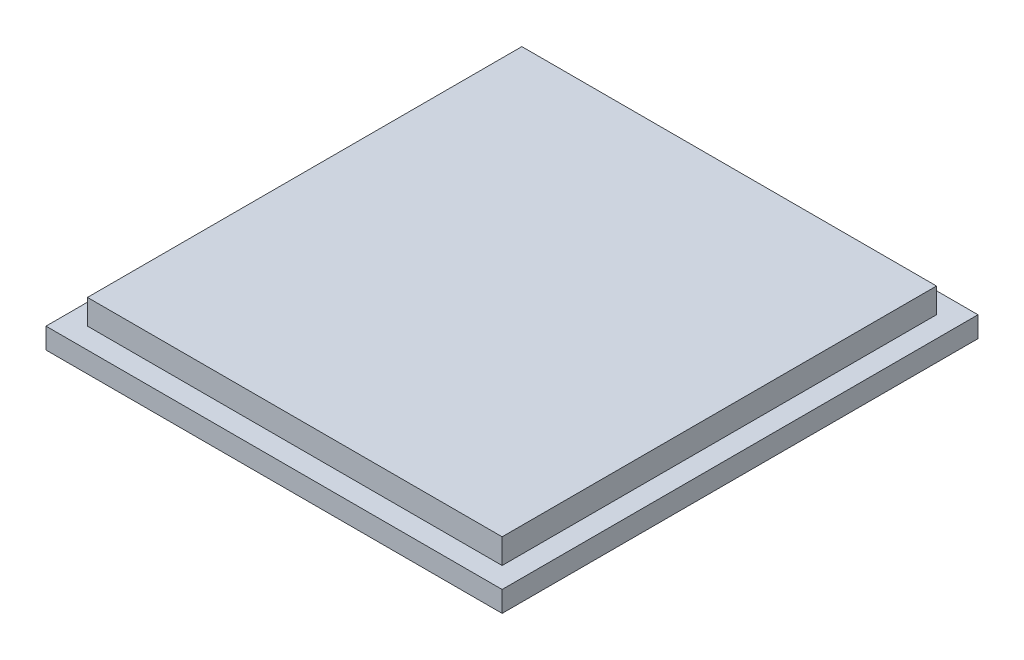
ISO-10303-21;
HEADER;
FILE_DESCRIPTION(('STEP AP214'),'2;1');
FILE_NAME('part.step','',(''),(''),'','','');
FILE_SCHEMA(('AUTOMOTIVE_DESIGN { 1 0 10303 214 1 1 1 1 }'));
ENDSEC;
DATA;
#1=APPLICATION_CONTEXT('core data for automotive mechanical design processes');
#2=APPLICATION_PROTOCOL_DEFINITION('international standard','automotive_design',2000,#1);
#3=PRODUCT_CONTEXT('',#1,'mechanical');
#4=PRODUCT('Part','Part','',(#3));
#5=PRODUCT_RELATED_PRODUCT_CATEGORY('part','',(#4));
#6=PRODUCT_DEFINITION_FORMATION('','',#4);
#7=PRODUCT_DEFINITION_CONTEXT('part definition',#1,'design');
#8=PRODUCT_DEFINITION('design','',#6,#7);
#9=PRODUCT_DEFINITION_SHAPE('','',#8);
#10=(LENGTH_UNIT() NAMED_UNIT(*) SI_UNIT(.MILLI.,.METRE.));
#11=(NAMED_UNIT(*) PLANE_ANGLE_UNIT() SI_UNIT($,.RADIAN.));
#12=(NAMED_UNIT(*) SI_UNIT($,.STERADIAN.) SOLID_ANGLE_UNIT());
#13=UNCERTAINTY_MEASURE_WITH_UNIT(LENGTH_MEASURE(1.E-05),#10,'distance_accuracy_value','');
#14=(GEOMETRIC_REPRESENTATION_CONTEXT(3) GLOBAL_UNCERTAINTY_ASSIGNED_CONTEXT((#13)) GLOBAL_UNIT_ASSIGNED_CONTEXT((#10,
#11,#12)) REPRESENTATION_CONTEXT('',''));
#15=CARTESIAN_POINT('',(0.,0.,0.));
#16=DIRECTION('',(0.,0.,1.));
#17=DIRECTION('',(1.,0.,0.));
#18=AXIS2_PLACEMENT_3D('',#15,#16,#17);
#19=CARTESIAN_POINT('',(0.,3.175,0.));
#20=DIRECTION('',(0.,-1.,0.));
#21=DIRECTION('',(0.,0.,-1.));
#22=AXIS2_PLACEMENT_3D('',#19,#20,#21);
#23=PLANE('',#22);
#24=DIRECTION('',(0.,0.,-1.));
#25=VECTOR('',#24,1.);
#26=CARTESIAN_POINT('',(34.925,3.175,36.4363));
#27=LINE('',#26,#25);
#28=CARTESIAN_POINT('',(34.925,3.175,36.4363));
#29=VERTEX_POINT('',#28);
#30=CARTESIAN_POINT('',(34.925,3.175,-36.4363));
#31=VERTEX_POINT('',#30);
#32=EDGE_CURVE('E139',#29,#31,#27,.T.);
#33=ORIENTED_EDGE('',*,*,#32,.T.);
#34=DIRECTION('',(-1.,0.,0.));
#35=VECTOR('',#34,1.);
#36=CARTESIAN_POINT('',(-34.925,3.175,-36.4363));
#37=LINE('',#36,#35);
#38=CARTESIAN_POINT('',(-34.925,3.175,-36.4363));
#39=VERTEX_POINT('',#38);
#40=EDGE_CURVE('E143',#31,#39,#37,.T.);
#41=ORIENTED_EDGE('',*,*,#40,.T.);
#42=DIRECTION('',(0.,0.,1.));
#43=VECTOR('',#42,1.);
#44=CARTESIAN_POINT('',(-34.925,3.175,36.4363));
#45=LINE('',#44,#43);
#46=CARTESIAN_POINT('',(-34.925,3.175,36.4363));
#47=VERTEX_POINT('',#46);
#48=EDGE_CURVE('E147',#39,#47,#45,.T.);
#49=ORIENTED_EDGE('',*,*,#48,.T.);
#50=DIRECTION('',(1.,0.,0.));
#51=VECTOR('',#50,1.);
#52=CARTESIAN_POINT('',(-34.925,3.175,36.4363));
#53=LINE('',#52,#51);
#54=EDGE_CURVE('E150',#47,#29,#53,.T.);
#55=ORIENTED_EDGE('',*,*,#54,.T.);
#56=EDGE_LOOP('',(#33,#41,#49,#55));
#57=FACE_BOUND('',#56,.T.);
#58=DIRECTION('',(1.,0.,0.));
#59=VECTOR('',#58,1.);
#60=CARTESIAN_POINT('',(-31.75,3.175,33.2613));
#61=LINE('',#60,#59);
#62=CARTESIAN_POINT('',(-31.75,3.175,33.2613));
#63=VERTEX_POINT('',#62);
#64=CARTESIAN_POINT('',(31.75,3.175,33.2613));
#65=VERTEX_POINT('',#64);
#66=EDGE_CURVE('E55',#63,#65,#61,.T.);
#67=ORIENTED_EDGE('',*,*,#66,.F.);
#68=DIRECTION('',(0.,0.,1.));
#69=VECTOR('',#68,1.);
#70=CARTESIAN_POINT('',(-31.75,3.175,-33.2613));
#71=LINE('',#70,#69);
#72=CARTESIAN_POINT('',(-31.75,3.175,-33.2613));
#73=VERTEX_POINT('',#72);
#74=EDGE_CURVE('E59',#73,#63,#71,.T.);
#75=ORIENTED_EDGE('',*,*,#74,.F.);
#76=DIRECTION('',(-1.,0.,0.));
#77=VECTOR('',#76,1.);
#78=CARTESIAN_POINT('',(31.75,3.175,-33.2613));
#79=LINE('',#78,#77);
#80=CARTESIAN_POINT('',(31.75,3.175,-33.2613));
#81=VERTEX_POINT('',#80);
#82=EDGE_CURVE('E283',#81,#73,#79,.T.);
#83=ORIENTED_EDGE('',*,*,#82,.F.);
#84=DIRECTION('',(0.,0.,-1.));
#85=VECTOR('',#84,1.);
#86=CARTESIAN_POINT('',(31.75,3.175,33.2613));
#87=LINE('',#86,#85);
#88=EDGE_CURVE('E293',#65,#81,#87,.T.);
#89=ORIENTED_EDGE('',*,*,#88,.F.);
#90=EDGE_LOOP('',(#67,#75,#83,#89));
#91=FACE_BOUND('',#90,.T.);
#92=ADVANCED_FACE('F39',(#57,#91),#23,.F.);
#93=CARTESIAN_POINT('',(34.925,3.175,36.4363));
#94=DIRECTION('',(-1.,0.,0.));
#95=DIRECTION('',(0.,0.,1.));
#96=AXIS2_PLACEMENT_3D('',#93,#94,#95);
#97=PLANE('',#96);
#98=DIRECTION('',(0.,0.,-1.));
#99=VECTOR('',#98,1.);
#100=CARTESIAN_POINT('',(34.925,0.,36.4363));
#101=LINE('',#100,#99);
#102=CARTESIAN_POINT('',(34.925,0.,36.4363));
#103=VERTEX_POINT('',#102);
#104=CARTESIAN_POINT('',(34.925,0.,-36.4363));
#105=VERTEX_POINT('',#104);
#106=EDGE_CURVE('E128',#103,#105,#101,.T.);
#107=ORIENTED_EDGE('',*,*,#106,.T.);
#108=DIRECTION('',(0.,-1.,0.));
#109=VECTOR('',#108,1.);
#110=CARTESIAN_POINT('',(34.925,3.175,-36.4363));
#111=LINE('',#110,#109);
#112=EDGE_CURVE('E11',#31,#105,#111,.T.);
#113=ORIENTED_EDGE('',*,*,#112,.F.);
#114=ORIENTED_EDGE('',*,*,#32,.F.);
#115=DIRECTION('',(0.,-1.,0.));
#116=VECTOR('',#115,1.);
#117=CARTESIAN_POINT('',(34.925,3.175,36.4363));
#118=LINE('',#117,#116);
#119=EDGE_CURVE('E152',#29,#103,#118,.T.);
#120=ORIENTED_EDGE('',*,*,#119,.T.);
#121=EDGE_LOOP('',(#107,#113,#114,#120));
#122=FACE_BOUND('',#121,.T.);
#123=ADVANCED_FACE('F41',(#122),#97,.F.);
#124=CARTESIAN_POINT('',(-34.925,3.175,-36.4363));
#125=DIRECTION('',(0.,0.,1.));
#126=DIRECTION('',(1.,0.,0.));
#127=AXIS2_PLACEMENT_3D('',#124,#125,#126);
#128=PLANE('',#127);
#129=DIRECTION('',(-1.,0.,0.));
#130=VECTOR('',#129,1.);
#131=CARTESIAN_POINT('',(-34.925,0.,-36.4363));
#132=LINE('',#131,#130);
#133=CARTESIAN_POINT('',(-34.925,0.,-36.4363));
#134=VERTEX_POINT('',#133);
#135=EDGE_CURVE('E133',#105,#134,#132,.T.);
#136=ORIENTED_EDGE('',*,*,#135,.T.);
#137=DIRECTION('',(0.,-1.,0.));
#138=VECTOR('',#137,1.);
#139=CARTESIAN_POINT('',(-34.925,3.175,-36.4363));
#140=LINE('',#139,#138);
#141=EDGE_CURVE('E48',#39,#134,#140,.T.);
#142=ORIENTED_EDGE('',*,*,#141,.F.);
#143=ORIENTED_EDGE('',*,*,#40,.F.);
#144=ORIENTED_EDGE('',*,*,#112,.T.);
#145=EDGE_LOOP('',(#136,#142,#143,#144));
#146=FACE_BOUND('',#145,.T.);
#147=ADVANCED_FACE('F188',(#146),#128,.F.);
#148=CARTESIAN_POINT('',(-34.925,3.175,36.4363));
#149=DIRECTION('',(1.,0.,0.));
#150=DIRECTION('',(0.,0.,-1.));
#151=AXIS2_PLACEMENT_3D('',#148,#149,#150);
#152=PLANE('',#151);
#153=DIRECTION('',(0.,0.,1.));
#154=VECTOR('',#153,1.);
#155=CARTESIAN_POINT('',(-34.925,0.,36.4363));
#156=LINE('',#155,#154);
#157=CARTESIAN_POINT('',(-34.925,0.,36.4363));
#158=VERTEX_POINT('',#157);
#159=EDGE_CURVE('E156',#134,#158,#156,.T.);
#160=ORIENTED_EDGE('',*,*,#159,.T.);
#161=DIRECTION('',(0.,-1.,0.));
#162=VECTOR('',#161,1.);
#163=CARTESIAN_POINT('',(-34.925,3.175,36.4363));
#164=LINE('',#163,#162);
#165=EDGE_CURVE('E164',#47,#158,#164,.T.);
#166=ORIENTED_EDGE('',*,*,#165,.F.);
#167=ORIENTED_EDGE('',*,*,#48,.F.);
#168=ORIENTED_EDGE('',*,*,#141,.T.);
#169=EDGE_LOOP('',(#160,#166,#167,#168));
#170=FACE_BOUND('',#169,.T.);
#171=ADVANCED_FACE('F173',(#170),#152,.F.);
#172=CARTESIAN_POINT('',(-34.925,3.175,36.4363));
#173=DIRECTION('',(0.,0.,-1.));
#174=DIRECTION('',(-1.,0.,0.));
#175=AXIS2_PLACEMENT_3D('',#172,#173,#174);
#176=PLANE('',#175);
#177=DIRECTION('',(1.,0.,0.));
#178=VECTOR('',#177,1.);
#179=CARTESIAN_POINT('',(-34.925,0.,36.4363));
#180=LINE('',#179,#178);
#181=EDGE_CURVE('E144',#158,#103,#180,.T.);
#182=ORIENTED_EDGE('',*,*,#181,.T.);
#183=ORIENTED_EDGE('',*,*,#119,.F.);
#184=ORIENTED_EDGE('',*,*,#54,.F.);
#185=ORIENTED_EDGE('',*,*,#165,.T.);
#186=EDGE_LOOP('',(#182,#183,#184,#185));
#187=FACE_BOUND('',#186,.T.);
#188=ADVANCED_FACE('F182',(#187),#176,.F.);
#189=CARTESIAN_POINT('',(0.,0.,0.));
#190=DIRECTION('',(0.,-1.,0.));
#191=DIRECTION('',(0.,0.,-1.));
#192=AXIS2_PLACEMENT_3D('',#189,#190,#191);
#193=PLANE('',#192);
#194=ORIENTED_EDGE('',*,*,#106,.F.);
#195=ORIENTED_EDGE('',*,*,#181,.F.);
#196=ORIENTED_EDGE('',*,*,#159,.F.);
#197=ORIENTED_EDGE('',*,*,#135,.F.);
#198=EDGE_LOOP('',(#194,#195,#196,#197));
#199=FACE_BOUND('',#198,.T.);
#200=ADVANCED_FACE('F179',(#199),#193,.T.);
#201=CARTESIAN_POINT('',(-31.75,6.985,33.2613));
#202=DIRECTION('',(0.,0.,-1.));
#203=DIRECTION('',(-1.,0.,0.));
#204=AXIS2_PLACEMENT_3D('',#201,#202,#203);
#205=PLANE('',#204);
#206=ORIENTED_EDGE('',*,*,#66,.T.);
#207=DIRECTION('',(0.,-1.,0.));
#208=VECTOR('',#207,1.);
#209=CARTESIAN_POINT('',(31.75,6.985,33.2613));
#210=LINE('',#209,#208);
#211=CARTESIAN_POINT('',(31.75,6.985,33.2613));
#212=VERTEX_POINT('',#211);
#213=EDGE_CURVE('E108',#212,#65,#210,.T.);
#214=ORIENTED_EDGE('',*,*,#213,.F.);
#215=DIRECTION('',(1.,0.,0.));
#216=VECTOR('',#215,1.);
#217=CARTESIAN_POINT('',(-31.75,6.985,33.2613));
#218=LINE('',#217,#216);
#219=CARTESIAN_POINT('',(-31.75,6.985,33.2613));
#220=VERTEX_POINT('',#219);
#221=EDGE_CURVE('E115',#220,#212,#218,.T.);
#222=ORIENTED_EDGE('',*,*,#221,.F.);
#223=DIRECTION('',(0.,-1.,0.));
#224=VECTOR('',#223,1.);
#225=CARTESIAN_POINT('',(-31.75,6.985,33.2613));
#226=LINE('',#225,#224);
#227=EDGE_CURVE('E280',#220,#63,#226,.T.);
#228=ORIENTED_EDGE('',*,*,#227,.T.);
#229=EDGE_LOOP('',(#206,#214,#222,#228));
#230=FACE_BOUND('',#229,.T.);
#231=ADVANCED_FACE('F126',(#230),#205,.F.);
#232=CARTESIAN_POINT('',(31.75,6.985,33.2613));
#233=DIRECTION('',(-1.,0.,0.));
#234=DIRECTION('',(0.,0.,1.));
#235=AXIS2_PLACEMENT_3D('',#232,#233,#234);
#236=PLANE('',#235);
#237=ORIENTED_EDGE('',*,*,#88,.T.);
#238=DIRECTION('',(0.,-1.,0.));
#239=VECTOR('',#238,1.);
#240=CARTESIAN_POINT('',(31.75,6.985,-33.2613));
#241=LINE('',#240,#239);
#242=CARTESIAN_POINT('',(31.75,6.985,-33.2613));
#243=VERTEX_POINT('',#242);
#244=EDGE_CURVE('E110',#243,#81,#241,.T.);
#245=ORIENTED_EDGE('',*,*,#244,.F.);
#246=DIRECTION('',(0.,0.,-1.));
#247=VECTOR('',#246,1.);
#248=CARTESIAN_POINT('',(31.75,6.985,33.2613));
#249=LINE('',#248,#247);
#250=EDGE_CURVE('E103',#212,#243,#249,.T.);
#251=ORIENTED_EDGE('',*,*,#250,.F.);
#252=ORIENTED_EDGE('',*,*,#213,.T.);
#253=EDGE_LOOP('',(#237,#245,#251,#252));
#254=FACE_BOUND('',#253,.T.);
#255=ADVANCED_FACE('F106',(#254),#236,.F.);
#256=CARTESIAN_POINT('',(31.75,6.985,-33.2613));
#257=DIRECTION('',(0.,0.,1.));
#258=DIRECTION('',(1.,0.,0.));
#259=AXIS2_PLACEMENT_3D('',#256,#257,#258);
#260=PLANE('',#259);
#261=ORIENTED_EDGE('',*,*,#82,.T.);
#262=DIRECTION('',(0.,-1.,0.));
#263=VECTOR('',#262,1.);
#264=CARTESIAN_POINT('',(-31.75,6.985,-33.2613));
#265=LINE('',#264,#263);
#266=CARTESIAN_POINT('',(-31.75,6.985,-33.2613));
#267=VERTEX_POINT('',#266);
#268=EDGE_CURVE('E135',#267,#73,#265,.T.);
#269=ORIENTED_EDGE('',*,*,#268,.F.);
#270=DIRECTION('',(-1.,0.,0.));
#271=VECTOR('',#270,1.);
#272=CARTESIAN_POINT('',(31.75,6.985,-33.2613));
#273=LINE('',#272,#271);
#274=EDGE_CURVE('E114',#243,#267,#273,.T.);
#275=ORIENTED_EDGE('',*,*,#274,.F.);
#276=ORIENTED_EDGE('',*,*,#244,.T.);
#277=EDGE_LOOP('',(#261,#269,#275,#276));
#278=FACE_BOUND('',#277,.T.);
#279=ADVANCED_FACE('F224',(#278),#260,.F.);
#280=CARTESIAN_POINT('',(-31.75,6.985,-33.2613));
#281=DIRECTION('',(1.,0.,0.));
#282=DIRECTION('',(0.,0.,-1.));
#283=AXIS2_PLACEMENT_3D('',#280,#281,#282);
#284=PLANE('',#283);
#285=ORIENTED_EDGE('',*,*,#74,.T.);
#286=ORIENTED_EDGE('',*,*,#227,.F.);
#287=DIRECTION('',(0.,0.,1.));
#288=VECTOR('',#287,1.);
#289=CARTESIAN_POINT('',(-31.75,6.985,-33.2613));
#290=LINE('',#289,#288);
#291=EDGE_CURVE('E120',#267,#220,#290,.T.);
#292=ORIENTED_EDGE('',*,*,#291,.F.);
#293=ORIENTED_EDGE('',*,*,#268,.T.);
#294=EDGE_LOOP('',(#285,#286,#292,#293));
#295=FACE_BOUND('',#294,.T.);
#296=ADVANCED_FACE('F230',(#295),#284,.F.);
#297=CARTESIAN_POINT('',(0.,6.985,0.));
#298=DIRECTION('',(0.,1.,0.));
#299=DIRECTION('',(0.,0.,1.));
#300=AXIS2_PLACEMENT_3D('',#297,#298,#299);
#301=PLANE('',#300);
#302=ORIENTED_EDGE('',*,*,#221,.T.);
#303=ORIENTED_EDGE('',*,*,#250,.T.);
#304=ORIENTED_EDGE('',*,*,#274,.T.);
#305=ORIENTED_EDGE('',*,*,#291,.T.);
#306=EDGE_LOOP('',(#302,#303,#304,#305));
#307=FACE_BOUND('',#306,.T.);
#308=ADVANCED_FACE('F118',(#307),#301,.T.);
#309=CLOSED_SHELL('',(#92,#123,#147,#171,#188,#200,#231,#255,#279,#296,#308));
#310=MANIFOLD_SOLID_BREP('B2',#309);
#311=ADVANCED_BREP_SHAPE_REPRESENTATION('',(#18,#310),#14);
#312=SHAPE_DEFINITION_REPRESENTATION(#9,#311);
ENDSEC;
END-ISO-10303-21;
